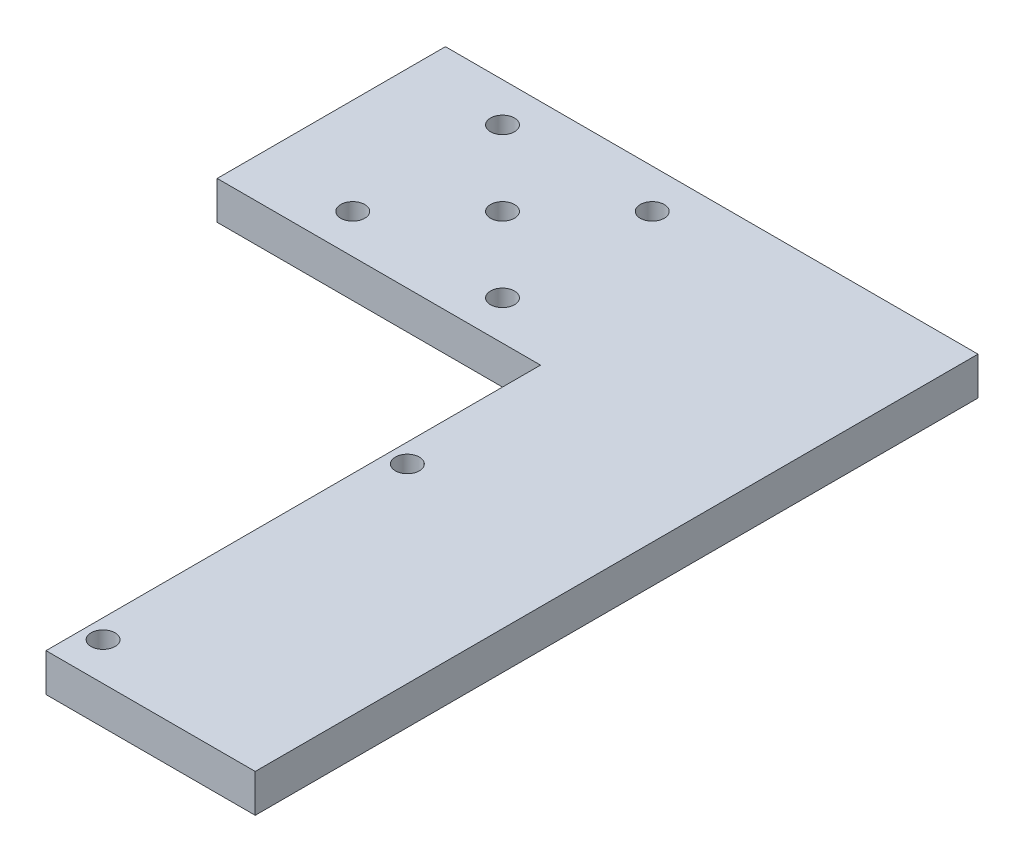
ISO-10303-21;
HEADER;
FILE_DESCRIPTION(('STEP AP214'),'2;1');
FILE_NAME('part.step','',(''),(''),'','','');
FILE_SCHEMA(('AUTOMOTIVE_DESIGN { 1 0 10303 214 1 1 1 1 }'));
ENDSEC;
DATA;
#1=APPLICATION_CONTEXT('core data for automotive mechanical design processes');
#2=APPLICATION_PROTOCOL_DEFINITION('international standard','automotive_design',2000,#1);
#3=PRODUCT_CONTEXT('',#1,'mechanical');
#4=PRODUCT('Part','Part','',(#3));
#5=PRODUCT_RELATED_PRODUCT_CATEGORY('part','',(#4));
#6=PRODUCT_DEFINITION_FORMATION('','',#4);
#7=PRODUCT_DEFINITION_CONTEXT('part definition',#1,'design');
#8=PRODUCT_DEFINITION('design','',#6,#7);
#9=PRODUCT_DEFINITION_SHAPE('','',#8);
#10=(LENGTH_UNIT() NAMED_UNIT(*) SI_UNIT(.MILLI.,.METRE.));
#11=(NAMED_UNIT(*) PLANE_ANGLE_UNIT() SI_UNIT($,.RADIAN.));
#12=(NAMED_UNIT(*) SI_UNIT($,.STERADIAN.) SOLID_ANGLE_UNIT());
#13=UNCERTAINTY_MEASURE_WITH_UNIT(LENGTH_MEASURE(1.E-05),#10,'distance_accuracy_value','');
#14=(GEOMETRIC_REPRESENTATION_CONTEXT(3) GLOBAL_UNCERTAINTY_ASSIGNED_CONTEXT((#13)) GLOBAL_UNIT_ASSIGNED_CONTEXT((#10,
#11,#12)) REPRESENTATION_CONTEXT('',''));
#15=CARTESIAN_POINT('',(0.,0.,0.));
#16=DIRECTION('',(0.,0.,1.));
#17=DIRECTION('',(1.,0.,0.));
#18=AXIS2_PLACEMENT_3D('',#15,#16,#17);
#19=CARTESIAN_POINT('',(0.,6.35,82.55));
#20=DIRECTION('',(0.,0.,-1.));
#21=DIRECTION('',(-1.,0.,0.));
#22=AXIS2_PLACEMENT_3D('',#19,#20,#21);
#23=PLANE('',#22);
#24=DIRECTION('',(1.,0.,0.));
#25=VECTOR('',#24,1.);
#26=CARTESIAN_POINT('',(0.,0.,82.55));
#27=LINE('',#26,#25);
#28=CARTESIAN_POINT('',(53.975,0.,82.55));
#29=VERTEX_POINT('',#28);
#30=CARTESIAN_POINT('',(88.9,0.,82.55));
#31=VERTEX_POINT('',#30);
#32=EDGE_CURVE('E160',#29,#31,#27,.T.);
#33=ORIENTED_EDGE('',*,*,#32,.T.);
#34=DIRECTION('',(0.,-1.,0.));
#35=VECTOR('',#34,1.);
#36=CARTESIAN_POINT('',(88.9,6.35,82.55));
#37=LINE('',#36,#35);
#38=CARTESIAN_POINT('',(88.9,6.35,82.55));
#39=VERTEX_POINT('',#38);
#40=EDGE_CURVE('E11',#39,#31,#37,.T.);
#41=ORIENTED_EDGE('',*,*,#40,.F.);
#42=DIRECTION('',(1.,0.,0.));
#43=VECTOR('',#42,1.);
#44=CARTESIAN_POINT('',(0.,6.35,82.55));
#45=LINE('',#44,#43);
#46=CARTESIAN_POINT('',(53.975,6.35,82.55));
#47=VERTEX_POINT('',#46);
#48=EDGE_CURVE('E195',#47,#39,#45,.T.);
#49=ORIENTED_EDGE('',*,*,#48,.F.);
#50=DIRECTION('',(0.,-1.,0.));
#51=VECTOR('',#50,1.);
#52=CARTESIAN_POINT('',(53.975,6.35,82.55));
#53=LINE('',#52,#51);
#54=EDGE_CURVE('E131',#47,#29,#53,.T.);
#55=ORIENTED_EDGE('',*,*,#54,.T.);
#56=EDGE_LOOP('',(#33,#41,#49,#55));
#57=FACE_BOUND('',#56,.T.);
#58=ADVANCED_FACE('F41',(#57),#23,.F.);
#59=CARTESIAN_POINT('',(88.9,6.35,0.));
#60=DIRECTION('',(-1.,0.,0.));
#61=DIRECTION('',(0.,0.,1.));
#62=AXIS2_PLACEMENT_3D('',#59,#60,#61);
#63=PLANE('',#62);
#64=DIRECTION('',(0.,0.,-1.));
#65=VECTOR('',#64,1.);
#66=CARTESIAN_POINT('',(88.9,0.,0.));
#67=LINE('',#66,#65);
#68=CARTESIAN_POINT('',(88.9,0.,-38.1));
#69=VERTEX_POINT('',#68);
#70=EDGE_CURVE('E164',#31,#69,#67,.T.);
#71=ORIENTED_EDGE('',*,*,#70,.T.);
#72=DIRECTION('',(0.,-1.,0.));
#73=VECTOR('',#72,1.);
#74=CARTESIAN_POINT('',(88.9,6.35,-38.1));
#75=LINE('',#74,#73);
#76=CARTESIAN_POINT('',(88.9,6.35,-38.1));
#77=VERTEX_POINT('',#76);
#78=EDGE_CURVE('E51',#77,#69,#75,.T.);
#79=ORIENTED_EDGE('',*,*,#78,.F.);
#80=DIRECTION('',(0.,0.,-1.));
#81=VECTOR('',#80,1.);
#82=CARTESIAN_POINT('',(88.9,6.35,0.));
#83=LINE('',#82,#81);
#84=EDGE_CURVE('E95',#39,#77,#83,.T.);
#85=ORIENTED_EDGE('',*,*,#84,.F.);
#86=ORIENTED_EDGE('',*,*,#40,.T.);
#87=EDGE_LOOP('',(#71,#79,#85,#86));
#88=FACE_BOUND('',#87,.T.);
#89=ADVANCED_FACE('F188',(#88),#63,.F.);
#90=CARTESIAN_POINT('',(0.,6.35,-38.1));
#91=DIRECTION('',(0.,0.,-1.));
#92=DIRECTION('',(-1.,0.,0.));
#93=AXIS2_PLACEMENT_3D('',#90,#91,#92);
#94=PLANE('',#93);
#95=DIRECTION('',(1.,0.,0.));
#96=VECTOR('',#95,1.);
#97=CARTESIAN_POINT('',(0.,0.,-38.1));
#98=LINE('',#97,#96);
#99=CARTESIAN_POINT('',(0.,0.,-38.1));
#100=VERTEX_POINT('',#99);
#101=EDGE_CURVE('E168',#100,#69,#98,.T.);
#102=ORIENTED_EDGE('',*,*,#101,.F.);
#103=DIRECTION('',(0.,-1.,0.));
#104=VECTOR('',#103,1.);
#105=CARTESIAN_POINT('',(0.,6.35,-38.1));
#106=LINE('',#105,#104);
#107=CARTESIAN_POINT('',(0.,6.35,-38.1));
#108=VERTEX_POINT('',#107);
#109=EDGE_CURVE('E112',#108,#100,#106,.T.);
#110=ORIENTED_EDGE('',*,*,#109,.F.);
#111=DIRECTION('',(1.,0.,0.));
#112=VECTOR('',#111,1.);
#113=CARTESIAN_POINT('',(0.,6.35,-38.1));
#114=LINE('',#113,#112);
#115=EDGE_CURVE('E122',#108,#77,#114,.T.);
#116=ORIENTED_EDGE('',*,*,#115,.T.);
#117=ORIENTED_EDGE('',*,*,#78,.T.);
#118=EDGE_LOOP('',(#102,#110,#116,#117));
#119=FACE_BOUND('',#118,.T.);
#120=ADVANCED_FACE('F187',(#119),#94,.T.);
#121=CARTESIAN_POINT('',(0.,6.35,0.));
#122=DIRECTION('',(-1.,0.,0.));
#123=DIRECTION('',(0.,0.,1.));
#124=AXIS2_PLACEMENT_3D('',#121,#122,#123);
#125=PLANE('',#124);
#126=DIRECTION('',(0.,0.,-1.));
#127=VECTOR('',#126,1.);
#128=CARTESIAN_POINT('',(0.,0.,0.));
#129=LINE('',#128,#127);
#130=CARTESIAN_POINT('',(0.,0.,0.));
#131=VERTEX_POINT('',#130);
#132=EDGE_CURVE('E110',#131,#100,#129,.T.);
#133=ORIENTED_EDGE('',*,*,#132,.F.);
#134=DIRECTION('',(0.,-1.,0.));
#135=VECTOR('',#134,1.);
#136=CARTESIAN_POINT('',(0.,6.35,0.));
#137=LINE('',#136,#135);
#138=CARTESIAN_POINT('',(0.,6.35,0.));
#139=VERTEX_POINT('',#138);
#140=EDGE_CURVE('E104',#139,#131,#137,.T.);
#141=ORIENTED_EDGE('',*,*,#140,.F.);
#142=DIRECTION('',(0.,0.,-1.));
#143=VECTOR('',#142,1.);
#144=CARTESIAN_POINT('',(0.,6.35,0.));
#145=LINE('',#144,#143);
#146=EDGE_CURVE('E108',#139,#108,#145,.T.);
#147=ORIENTED_EDGE('',*,*,#146,.T.);
#148=ORIENTED_EDGE('',*,*,#109,.T.);
#149=EDGE_LOOP('',(#133,#141,#147,#148));
#150=FACE_BOUND('',#149,.T.);
#151=ADVANCED_FACE('F106',(#150),#125,.T.);
#152=CARTESIAN_POINT('',(0.,6.35,0.));
#153=DIRECTION('',(0.,0.,-1.));
#154=DIRECTION('',(-1.,0.,0.));
#155=AXIS2_PLACEMENT_3D('',#152,#153,#154);
#156=PLANE('',#155);
#157=DIRECTION('',(1.,0.,0.));
#158=VECTOR('',#157,1.);
#159=CARTESIAN_POINT('',(0.,0.,0.));
#160=LINE('',#159,#158);
#161=CARTESIAN_POINT('',(53.975,0.,0.));
#162=VERTEX_POINT('',#161);
#163=EDGE_CURVE('E81',#131,#162,#160,.T.);
#164=ORIENTED_EDGE('',*,*,#163,.T.);
#165=DIRECTION('',(0.,-1.,0.));
#166=VECTOR('',#165,1.);
#167=CARTESIAN_POINT('',(53.975,6.35,0.));
#168=LINE('',#167,#166);
#169=CARTESIAN_POINT('',(53.975,6.35,0.));
#170=VERTEX_POINT('',#169);
#171=EDGE_CURVE('E113',#170,#162,#168,.T.);
#172=ORIENTED_EDGE('',*,*,#171,.F.);
#173=DIRECTION('',(1.,0.,0.));
#174=VECTOR('',#173,1.);
#175=CARTESIAN_POINT('',(0.,6.35,0.));
#176=LINE('',#175,#174);
#177=EDGE_CURVE('E115',#139,#170,#176,.T.);
#178=ORIENTED_EDGE('',*,*,#177,.F.);
#179=ORIENTED_EDGE('',*,*,#140,.T.);
#180=EDGE_LOOP('',(#164,#172,#178,#179));
#181=FACE_BOUND('',#180,.T.);
#182=ADVANCED_FACE('F116',(#181),#156,.F.);
#183=CARTESIAN_POINT('',(16.075,6.35,-31.55));
#184=DIRECTION('',(0.,-1.,0.));
#185=DIRECTION('',(0.,0.,-1.));
#186=AXIS2_PLACEMENT_3D('',#183,#184,#185);
#187=CYLINDRICAL_SURFACE('',#186,2.);
#188=CARTESIAN_POINT('',(16.075,6.35,-31.55));
#189=DIRECTION('',(0.,1.,0.));
#190=DIRECTION('',(0.,0.,1.));
#191=AXIS2_PLACEMENT_3D('',#188,#189,#190);
#192=CIRCLE('',#191,2.);
#193=CARTESIAN_POINT('',(16.075,6.35,-29.55));
#194=VERTEX_POINT('',#193);
#195=EDGE_CURVE('E382',#194,#194,#192,.T.);
#196=ORIENTED_EDGE('',*,*,#195,.T.);
#197=EDGE_LOOP('',(#196));
#198=FACE_BOUND('',#197,.T.);
#199=CARTESIAN_POINT('',(16.075,0.,-31.55));
#200=DIRECTION('',(0.,1.,0.));
#201=DIRECTION('',(0.,0.,1.));
#202=AXIS2_PLACEMENT_3D('',#199,#200,#201);
#203=CIRCLE('',#202,2.);
#204=CARTESIAN_POINT('',(16.075,0.,-29.55));
#205=VERTEX_POINT('',#204);
#206=EDGE_CURVE('E156',#205,#205,#203,.T.);
#207=ORIENTED_EDGE('',*,*,#206,.F.);
#208=EDGE_LOOP('',(#207));
#209=FACE_BOUND('',#208,.T.);
#210=ADVANCED_FACE('F217',(#198,#209),#187,.F.);
#211=CARTESIAN_POINT('',(41.075,6.35,-31.55));
#212=DIRECTION('',(0.,-1.,0.));
#213=DIRECTION('',(0.,0.,-1.));
#214=AXIS2_PLACEMENT_3D('',#211,#212,#213);
#215=CYLINDRICAL_SURFACE('',#214,2.);
#216=CARTESIAN_POINT('',(41.075,6.35,-31.55));
#217=DIRECTION('',(0.,1.,0.));
#218=DIRECTION('',(0.,0.,1.));
#219=AXIS2_PLACEMENT_3D('',#216,#217,#218);
#220=CIRCLE('',#219,2.);
#221=CARTESIAN_POINT('',(41.075,6.35,-29.55));
#222=VERTEX_POINT('',#221);
#223=EDGE_CURVE('E378',#222,#222,#220,.T.);
#224=ORIENTED_EDGE('',*,*,#223,.T.);
#225=EDGE_LOOP('',(#224));
#226=FACE_BOUND('',#225,.T.);
#227=CARTESIAN_POINT('',(41.075,0.,-31.55));
#228=DIRECTION('',(0.,1.,0.));
#229=DIRECTION('',(0.,0.,1.));
#230=AXIS2_PLACEMENT_3D('',#227,#228,#229);
#231=CIRCLE('',#230,2.);
#232=CARTESIAN_POINT('',(41.075,0.,-29.55));
#233=VERTEX_POINT('',#232);
#234=EDGE_CURVE('E152',#233,#233,#231,.T.);
#235=ORIENTED_EDGE('',*,*,#234,.F.);
#236=EDGE_LOOP('',(#235));
#237=FACE_BOUND('',#236,.T.);
#238=ADVANCED_FACE('F220',(#226,#237),#215,.F.);
#239=CARTESIAN_POINT('',(16.075,6.35,-6.55));
#240=DIRECTION('',(0.,-1.,0.));
#241=DIRECTION('',(0.,0.,-1.));
#242=AXIS2_PLACEMENT_3D('',#239,#240,#241);
#243=CYLINDRICAL_SURFACE('',#242,2.);
#244=CARTESIAN_POINT('',(16.075,6.35,-6.55));
#245=DIRECTION('',(0.,1.,0.));
#246=DIRECTION('',(0.,0.,1.));
#247=AXIS2_PLACEMENT_3D('',#244,#245,#246);
#248=CIRCLE('',#247,2.);
#249=CARTESIAN_POINT('',(16.075,6.35,-4.55));
#250=VERTEX_POINT('',#249);
#251=EDGE_CURVE('E374',#250,#250,#248,.T.);
#252=ORIENTED_EDGE('',*,*,#251,.T.);
#253=EDGE_LOOP('',(#252));
#254=FACE_BOUND('',#253,.T.);
#255=CARTESIAN_POINT('',(16.075,0.,-6.55));
#256=DIRECTION('',(0.,1.,0.));
#257=DIRECTION('',(0.,0.,1.));
#258=AXIS2_PLACEMENT_3D('',#255,#256,#257);
#259=CIRCLE('',#258,2.);
#260=CARTESIAN_POINT('',(16.075,0.,-4.55));
#261=VERTEX_POINT('',#260);
#262=EDGE_CURVE('E148',#261,#261,#259,.T.);
#263=ORIENTED_EDGE('',*,*,#262,.F.);
#264=EDGE_LOOP('',(#263));
#265=FACE_BOUND('',#264,.T.);
#266=ADVANCED_FACE('F224',(#254,#265),#243,.F.);
#267=CARTESIAN_POINT('',(41.075,6.35,-6.55));
#268=DIRECTION('',(0.,-1.,0.));
#269=DIRECTION('',(0.,0.,-1.));
#270=AXIS2_PLACEMENT_3D('',#267,#268,#269);
#271=CYLINDRICAL_SURFACE('',#270,2.);
#272=CARTESIAN_POINT('',(41.075,6.35,-6.55));
#273=DIRECTION('',(0.,1.,0.));
#274=DIRECTION('',(0.,0.,1.));
#275=AXIS2_PLACEMENT_3D('',#272,#273,#274);
#276=CIRCLE('',#275,2.);
#277=CARTESIAN_POINT('',(41.075,6.35,-4.55));
#278=VERTEX_POINT('',#277);
#279=EDGE_CURVE('E366',#278,#278,#276,.T.);
#280=ORIENTED_EDGE('',*,*,#279,.T.);
#281=EDGE_LOOP('',(#280));
#282=FACE_BOUND('',#281,.T.);
#283=CARTESIAN_POINT('',(41.075,0.,-6.55));
#284=DIRECTION('',(0.,1.,0.));
#285=DIRECTION('',(0.,0.,1.));
#286=AXIS2_PLACEMENT_3D('',#283,#284,#285);
#287=CIRCLE('',#286,2.);
#288=CARTESIAN_POINT('',(41.075,0.,-4.55));
#289=VERTEX_POINT('',#288);
#290=EDGE_CURVE('E144',#289,#289,#287,.T.);
#291=ORIENTED_EDGE('',*,*,#290,.F.);
#292=EDGE_LOOP('',(#291));
#293=FACE_BOUND('',#292,.T.);
#294=ADVANCED_FACE('F228',(#282,#293),#271,.F.);
#295=CARTESIAN_POINT('',(28.575,6.35,-19.05));
#296=DIRECTION('',(0.,-1.,0.));
#297=DIRECTION('',(0.,0.,-1.));
#298=AXIS2_PLACEMENT_3D('',#295,#296,#297);
#299=CYLINDRICAL_SURFACE('',#298,2.00000000000001);
#300=CARTESIAN_POINT('',(28.575,6.35,-19.05));
#301=DIRECTION('',(0.,1.,0.));
#302=DIRECTION('',(0.,0.,1.));
#303=AXIS2_PLACEMENT_3D('',#300,#301,#302);
#304=CIRCLE('',#303,2.00000000000001);
#305=CARTESIAN_POINT('',(28.575,6.35,-17.05));
#306=VERTEX_POINT('',#305);
#307=EDGE_CURVE('E361',#306,#306,#304,.T.);
#308=ORIENTED_EDGE('',*,*,#307,.T.);
#309=EDGE_LOOP('',(#308));
#310=FACE_BOUND('',#309,.T.);
#311=CARTESIAN_POINT('',(28.575,0.,-19.05));
#312=DIRECTION('',(0.,1.,0.));
#313=DIRECTION('',(0.,0.,1.));
#314=AXIS2_PLACEMENT_3D('',#311,#312,#313);
#315=CIRCLE('',#314,2.00000000000001);
#316=CARTESIAN_POINT('',(28.575,0.,-17.05));
#317=VERTEX_POINT('',#316);
#318=EDGE_CURVE('E140',#317,#317,#315,.T.);
#319=ORIENTED_EDGE('',*,*,#318,.F.);
#320=EDGE_LOOP('',(#319));
#321=FACE_BOUND('',#320,.T.);
#322=ADVANCED_FACE('F232',(#310,#321),#299,.F.);
#323=CARTESIAN_POINT('',(57.15,6.35,25.4));
#324=DIRECTION('',(0.,-1.,0.));
#325=DIRECTION('',(0.,0.,-1.));
#326=AXIS2_PLACEMENT_3D('',#323,#324,#325);
#327=CYLINDRICAL_SURFACE('',#326,2.);
#328=CARTESIAN_POINT('',(57.15,6.35,25.4));
#329=DIRECTION('',(0.,1.,0.));
#330=DIRECTION('',(0.,0.,1.));
#331=AXIS2_PLACEMENT_3D('',#328,#329,#330);
#332=CIRCLE('',#331,2.);
#333=CARTESIAN_POINT('',(57.15,6.35,27.4));
#334=VERTEX_POINT('',#333);
#335=EDGE_CURVE('E243',#334,#334,#332,.T.);
#336=ORIENTED_EDGE('',*,*,#335,.T.);
#337=EDGE_LOOP('',(#336));
#338=FACE_BOUND('',#337,.T.);
#339=CARTESIAN_POINT('',(57.15,0.,25.4));
#340=DIRECTION('',(0.,1.,0.));
#341=DIRECTION('',(0.,0.,1.));
#342=AXIS2_PLACEMENT_3D('',#339,#340,#341);
#343=CIRCLE('',#342,2.);
#344=CARTESIAN_POINT('',(57.15,0.,27.4));
#345=VERTEX_POINT('',#344);
#346=EDGE_CURVE('E136',#345,#345,#343,.T.);
#347=ORIENTED_EDGE('',*,*,#346,.F.);
#348=EDGE_LOOP('',(#347));
#349=FACE_BOUND('',#348,.T.);
#350=ADVANCED_FACE('F205',(#338,#349),#327,.F.);
#351=CARTESIAN_POINT('',(57.15,6.35,76.2));
#352=DIRECTION('',(0.,-1.,0.));
#353=DIRECTION('',(0.,0.,-1.));
#354=AXIS2_PLACEMENT_3D('',#351,#352,#353);
#355=CYLINDRICAL_SURFACE('',#354,2.);
#356=CARTESIAN_POINT('',(57.15,6.35,76.2));
#357=DIRECTION('',(0.,1.,0.));
#358=DIRECTION('',(0.,0.,1.));
#359=AXIS2_PLACEMENT_3D('',#356,#357,#358);
#360=CIRCLE('',#359,2.);
#361=CARTESIAN_POINT('',(57.15,6.35,78.2));
#362=VERTEX_POINT('',#361);
#363=EDGE_CURVE('E178',#362,#362,#360,.T.);
#364=ORIENTED_EDGE('',*,*,#363,.T.);
#365=EDGE_LOOP('',(#364));
#366=FACE_BOUND('',#365,.T.);
#367=CARTESIAN_POINT('',(57.15,0.,76.2));
#368=DIRECTION('',(0.,1.,0.));
#369=DIRECTION('',(0.,0.,1.));
#370=AXIS2_PLACEMENT_3D('',#367,#368,#369);
#371=CIRCLE('',#370,2.);
#372=CARTESIAN_POINT('',(57.15,0.,78.2));
#373=VERTEX_POINT('',#372);
#374=EDGE_CURVE('E132',#373,#373,#371,.T.);
#375=ORIENTED_EDGE('',*,*,#374,.F.);
#376=EDGE_LOOP('',(#375));
#377=FACE_BOUND('',#376,.T.);
#378=ADVANCED_FACE('F43',(#366,#377),#355,.F.);
#379=CARTESIAN_POINT('',(53.975,6.35,0.));
#380=DIRECTION('',(1.,0.,0.));
#381=DIRECTION('',(0.,0.,-1.));
#382=AXIS2_PLACEMENT_3D('',#379,#380,#381);
#383=PLANE('',#382);
#384=DIRECTION('',(0.,0.,1.));
#385=VECTOR('',#384,1.);
#386=CARTESIAN_POINT('',(53.975,0.,0.));
#387=LINE('',#386,#385);
#388=EDGE_CURVE('E87',#162,#29,#387,.T.);
#389=ORIENTED_EDGE('',*,*,#388,.T.);
#390=ORIENTED_EDGE('',*,*,#54,.F.);
#391=DIRECTION('',(0.,0.,1.));
#392=VECTOR('',#391,1.);
#393=CARTESIAN_POINT('',(53.975,6.35,0.));
#394=LINE('',#393,#392);
#395=EDGE_CURVE('E59',#170,#47,#394,.T.);
#396=ORIENTED_EDGE('',*,*,#395,.F.);
#397=ORIENTED_EDGE('',*,*,#171,.T.);
#398=EDGE_LOOP('',(#389,#390,#396,#397));
#399=FACE_BOUND('',#398,.T.);
#400=ADVANCED_FACE('F196',(#399),#383,.F.);
#401=CARTESIAN_POINT('',(0.,6.35,0.));
#402=DIRECTION('',(0.,1.,0.));
#403=DIRECTION('',(0.,0.,1.));
#404=AXIS2_PLACEMENT_3D('',#401,#402,#403);
#405=PLANE('',#404);
#406=ORIENTED_EDGE('',*,*,#363,.F.);
#407=EDGE_LOOP('',(#406));
#408=FACE_BOUND('',#407,.T.);
#409=ORIENTED_EDGE('',*,*,#335,.F.);
#410=EDGE_LOOP('',(#409));
#411=FACE_BOUND('',#410,.T.);
#412=ORIENTED_EDGE('',*,*,#307,.F.);
#413=EDGE_LOOP('',(#412));
#414=FACE_BOUND('',#413,.T.);
#415=ORIENTED_EDGE('',*,*,#279,.F.);
#416=EDGE_LOOP('',(#415));
#417=FACE_BOUND('',#416,.T.);
#418=ORIENTED_EDGE('',*,*,#251,.F.);
#419=EDGE_LOOP('',(#418));
#420=FACE_BOUND('',#419,.T.);
#421=ORIENTED_EDGE('',*,*,#223,.F.);
#422=EDGE_LOOP('',(#421));
#423=FACE_BOUND('',#422,.T.);
#424=ORIENTED_EDGE('',*,*,#195,.F.);
#425=EDGE_LOOP('',(#424));
#426=FACE_BOUND('',#425,.T.);
#427=ORIENTED_EDGE('',*,*,#48,.T.);
#428=ORIENTED_EDGE('',*,*,#84,.T.);
#429=ORIENTED_EDGE('',*,*,#115,.F.);
#430=ORIENTED_EDGE('',*,*,#146,.F.);
#431=ORIENTED_EDGE('',*,*,#177,.T.);
#432=ORIENTED_EDGE('',*,*,#395,.T.);
#433=EDGE_LOOP('',(#427,#428,#429,#430,#431,#432));
#434=FACE_BOUND('',#433,.T.);
#435=ADVANCED_FACE('F120',(#408,#411,#414,#417,#420,#423,#426,#434),#405,.T.);
#436=CARTESIAN_POINT('',(0.,0.,0.));
#437=DIRECTION('',(0.,1.,0.));
#438=DIRECTION('',(0.,0.,1.));
#439=AXIS2_PLACEMENT_3D('',#436,#437,#438);
#440=PLANE('',#439);
#441=ORIENTED_EDGE('',*,*,#374,.T.);
#442=EDGE_LOOP('',(#441));
#443=FACE_BOUND('',#442,.T.);
#444=ORIENTED_EDGE('',*,*,#346,.T.);
#445=EDGE_LOOP('',(#444));
#446=FACE_BOUND('',#445,.T.);
#447=ORIENTED_EDGE('',*,*,#318,.T.);
#448=EDGE_LOOP('',(#447));
#449=FACE_BOUND('',#448,.T.);
#450=ORIENTED_EDGE('',*,*,#290,.T.);
#451=EDGE_LOOP('',(#450));
#452=FACE_BOUND('',#451,.T.);
#453=ORIENTED_EDGE('',*,*,#262,.T.);
#454=EDGE_LOOP('',(#453));
#455=FACE_BOUND('',#454,.T.);
#456=ORIENTED_EDGE('',*,*,#234,.T.);
#457=EDGE_LOOP('',(#456));
#458=FACE_BOUND('',#457,.T.);
#459=ORIENTED_EDGE('',*,*,#206,.T.);
#460=EDGE_LOOP('',(#459));
#461=FACE_BOUND('',#460,.T.);
#462=ORIENTED_EDGE('',*,*,#32,.F.);
#463=ORIENTED_EDGE('',*,*,#388,.F.);
#464=ORIENTED_EDGE('',*,*,#163,.F.);
#465=ORIENTED_EDGE('',*,*,#132,.T.);
#466=ORIENTED_EDGE('',*,*,#101,.T.);
#467=ORIENTED_EDGE('',*,*,#70,.F.);
#468=EDGE_LOOP('',(#462,#463,#464,#465,#466,#467));
#469=FACE_BOUND('',#468,.T.);
#470=ADVANCED_FACE('F192',(#443,#446,#449,#452,#455,#458,#461,#469),#440,.F.);
#471=CLOSED_SHELL('',(#58,#89,#120,#151,#182,#210,#238,#266,#294,#322,#350,#378,#400,#435,#470));
#472=MANIFOLD_SOLID_BREP('B2',#471);
#473=ADVANCED_BREP_SHAPE_REPRESENTATION('',(#18,#472),#14);
#474=SHAPE_DEFINITION_REPRESENTATION(#9,#473);
ENDSEC;
END-ISO-10303-21;
